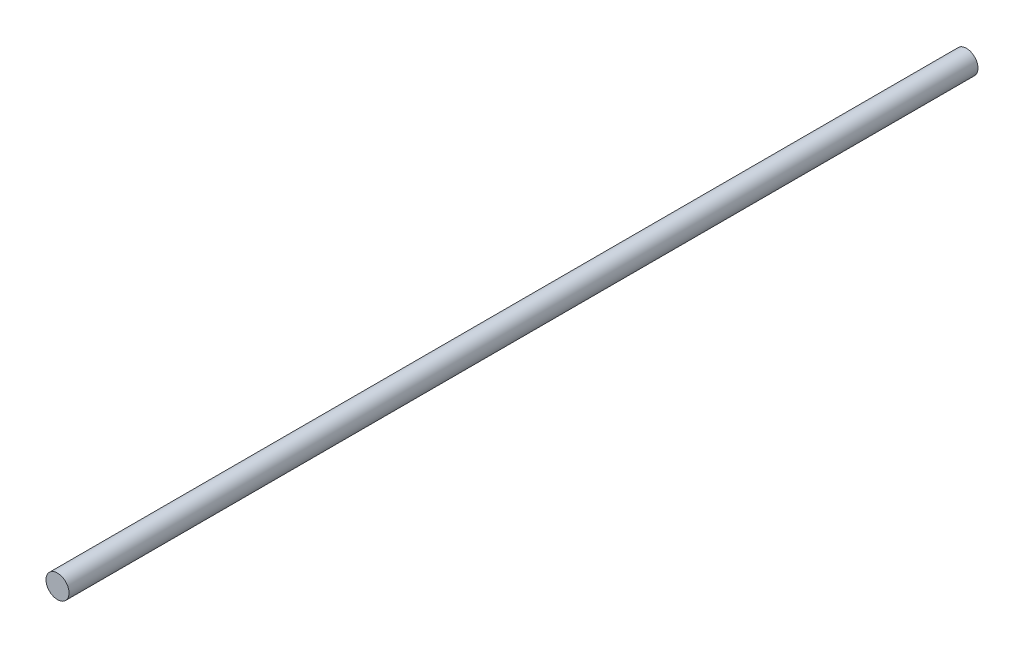
ISO-10303-21;
HEADER;
FILE_DESCRIPTION(('STEP AP214'),'2;1');
FILE_NAME('part.step','',(''),(''),'','','');
FILE_SCHEMA(('AUTOMOTIVE_DESIGN { 1 0 10303 214 1 1 1 1 }'));
ENDSEC;
DATA;
#1=APPLICATION_CONTEXT('core data for automotive mechanical design processes');
#2=APPLICATION_PROTOCOL_DEFINITION('international standard','automotive_design',2000,#1);
#3=PRODUCT_CONTEXT('',#1,'mechanical');
#4=PRODUCT('Part','Part','',(#3));
#5=PRODUCT_RELATED_PRODUCT_CATEGORY('part','',(#4));
#6=PRODUCT_DEFINITION_FORMATION('','',#4);
#7=PRODUCT_DEFINITION_CONTEXT('part definition',#1,'design');
#8=PRODUCT_DEFINITION('design','',#6,#7);
#9=PRODUCT_DEFINITION_SHAPE('','',#8);
#10=(LENGTH_UNIT() NAMED_UNIT(*) SI_UNIT(.MILLI.,.METRE.));
#11=(NAMED_UNIT(*) PLANE_ANGLE_UNIT() SI_UNIT($,.RADIAN.));
#12=(NAMED_UNIT(*) SI_UNIT($,.STERADIAN.) SOLID_ANGLE_UNIT());
#13=UNCERTAINTY_MEASURE_WITH_UNIT(LENGTH_MEASURE(1.E-05),#10,'distance_accuracy_value','');
#14=(GEOMETRIC_REPRESENTATION_CONTEXT(3) GLOBAL_UNCERTAINTY_ASSIGNED_CONTEXT((#13)) GLOBAL_UNIT_ASSIGNED_CONTEXT((#10,
#11,#12)) REPRESENTATION_CONTEXT('',''));
#15=CARTESIAN_POINT('',(0.,0.,0.));
#16=DIRECTION('',(0.,0.,1.));
#17=DIRECTION('',(1.,0.,0.));
#18=AXIS2_PLACEMENT_3D('',#15,#16,#17);
#19=CARTESIAN_POINT('',(0.,0.,39.44));
#20=DIRECTION('',(0.,0.,-1.));
#21=DIRECTION('',(-1.,0.,0.));
#22=AXIS2_PLACEMENT_3D('',#19,#20,#21);
#23=CYLINDRICAL_SURFACE('',#22,0.5);
#24=CARTESIAN_POINT('',(0.,0.,39.44));
#25=DIRECTION('',(0.,0.,1.));
#26=DIRECTION('',(1.,0.,0.));
#27=AXIS2_PLACEMENT_3D('',#24,#25,#26);
#28=CIRCLE('',#27,0.5);
#29=CARTESIAN_POINT('',(0.5,0.,39.44));
#30=VERTEX_POINT('',#29);
#31=EDGE_CURVE('E10',#30,#30,#28,.T.);
#32=ORIENTED_EDGE('',*,*,#31,.F.);
#33=EDGE_LOOP('',(#32));
#34=FACE_BOUND('',#33,.T.);
#35=CARTESIAN_POINT('',(0.,0.,0.));
#36=DIRECTION('',(0.,0.,1.));
#37=DIRECTION('',(1.,0.,0.));
#38=AXIS2_PLACEMENT_3D('',#35,#36,#37);
#39=CIRCLE('',#38,0.5);
#40=CARTESIAN_POINT('',(0.5,0.,0.));
#41=VERTEX_POINT('',#40);
#42=EDGE_CURVE('E46',#41,#41,#39,.T.);
#43=ORIENTED_EDGE('',*,*,#42,.T.);
#44=EDGE_LOOP('',(#43));
#45=FACE_BOUND('',#44,.T.);
#46=ADVANCED_FACE('F43',(#34,#45),#23,.T.);
#47=CARTESIAN_POINT('',(0.,0.,39.44));
#48=DIRECTION('',(0.,0.,1.));
#49=DIRECTION('',(1.,0.,0.));
#50=AXIS2_PLACEMENT_3D('',#47,#48,#49);
#51=PLANE('',#50);
#52=ORIENTED_EDGE('',*,*,#31,.T.);
#53=EDGE_LOOP('',(#52));
#54=FACE_BOUND('',#53,.T.);
#55=ADVANCED_FACE('F60',(#54),#51,.T.);
#56=CARTESIAN_POINT('',(0.,0.,0.));
#57=DIRECTION('',(0.,0.,1.));
#58=DIRECTION('',(1.,0.,0.));
#59=AXIS2_PLACEMENT_3D('',#56,#57,#58);
#60=PLANE('',#59);
#61=ORIENTED_EDGE('',*,*,#42,.F.);
#62=EDGE_LOOP('',(#61));
#63=FACE_BOUND('',#62,.T.);
#64=ADVANCED_FACE('F58',(#63),#60,.F.);
#65=CLOSED_SHELL('',(#46,#55,#64));
#66=MANIFOLD_SOLID_BREP('B2',#65);
#67=ADVANCED_BREP_SHAPE_REPRESENTATION('',(#18,#66),#14);
#68=SHAPE_DEFINITION_REPRESENTATION(#9,#67);
ENDSEC;
END-ISO-10303-21;
